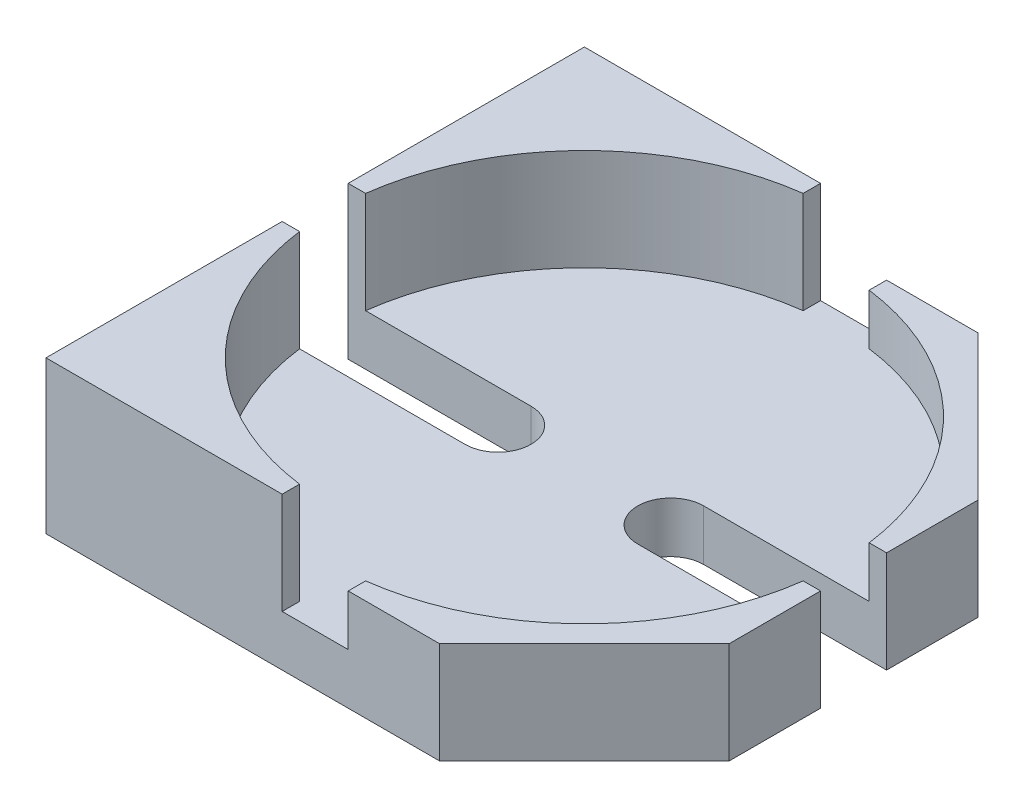
ISO-10303-21;
HEADER;
FILE_DESCRIPTION(('STEP AP214'),'2;1');
FILE_NAME('part.step','',(''),(''),'','','');
FILE_SCHEMA(('AUTOMOTIVE_DESIGN { 1 0 10303 214 1 1 1 1 }'));
ENDSEC;
DATA;
#1=APPLICATION_CONTEXT('core data for automotive mechanical design processes');
#2=APPLICATION_PROTOCOL_DEFINITION('international standard','automotive_design',2000,#1);
#3=PRODUCT_CONTEXT('',#1,'mechanical');
#4=PRODUCT('Part','Part','',(#3));
#5=PRODUCT_RELATED_PRODUCT_CATEGORY('part','',(#4));
#6=PRODUCT_DEFINITION_FORMATION('','',#4);
#7=PRODUCT_DEFINITION_CONTEXT('part definition',#1,'design');
#8=PRODUCT_DEFINITION('design','',#6,#7);
#9=PRODUCT_DEFINITION_SHAPE('','',#8);
#10=(LENGTH_UNIT() NAMED_UNIT(*) SI_UNIT(.MILLI.,.METRE.));
#11=(NAMED_UNIT(*) PLANE_ANGLE_UNIT() SI_UNIT($,.RADIAN.));
#12=(NAMED_UNIT(*) SI_UNIT($,.STERADIAN.) SOLID_ANGLE_UNIT());
#13=UNCERTAINTY_MEASURE_WITH_UNIT(LENGTH_MEASURE(1.E-05),#10,'distance_accuracy_value','');
#14=(GEOMETRIC_REPRESENTATION_CONTEXT(3) GLOBAL_UNCERTAINTY_ASSIGNED_CONTEXT((#13)) GLOBAL_UNIT_ASSIGNED_CONTEXT((#10,
#11,#12)) REPRESENTATION_CONTEXT('',''));
#15=CARTESIAN_POINT('',(0.,0.,0.));
#16=DIRECTION('',(0.,0.,1.));
#17=DIRECTION('',(1.,0.,0.));
#18=AXIS2_PLACEMENT_3D('',#15,#16,#17);
#19=CARTESIAN_POINT('',(0.,1.,0.));
#20=DIRECTION('',(0.,1.,0.));
#21=DIRECTION('',(1.,0.,0.));
#22=AXIS2_PLACEMENT_3D('',#19,#20,#21);
#23=PLANE('',#22);
#24=CARTESIAN_POINT('',(0.,1.,0.));
#25=DIRECTION('',(0.,1.,0.));
#26=DIRECTION('',(0.,0.,1.));
#27=AXIS2_PLACEMENT_3D('',#24,#25,#26);
#28=CIRCLE('',#27,2.5);
#29=CARTESIAN_POINT('',(0.325000000000007,1.,2.47878498462453));
#30=VERTEX_POINT('',#29);
#31=CARTESIAN_POINT('',(2.47878498462453,1.,0.325));
#32=VERTEX_POINT('',#31);
#33=EDGE_CURVE('E25',#30,#32,#28,.T.);
#34=ORIENTED_EDGE('',*,*,#33,.F.);
#35=DIRECTION('',(0.,0.,-1.));
#36=VECTOR('',#35,1.);
#37=CARTESIAN_POINT('',(0.325000000000007,1.,0.));
#38=LINE('',#37,#36);
#39=CARTESIAN_POINT('',(0.325000000000007,1.,2.65));
#40=VERTEX_POINT('',#39);
#41=EDGE_CURVE('E11',#40,#30,#38,.T.);
#42=ORIENTED_EDGE('',*,*,#41,.F.);
#43=DIRECTION('',(1.,0.,0.));
#44=VECTOR('',#43,1.);
#45=CARTESIAN_POINT('',(0.,1.,2.65));
#46=LINE('',#45,#44);
#47=CARTESIAN_POINT('',(1.22500000000002,1.,2.65));
#48=VERTEX_POINT('',#47);
#49=EDGE_CURVE('E353',#40,#48,#46,.T.);
#50=ORIENTED_EDGE('',*,*,#49,.T.);
#51=DIRECTION('',(0.707106781186544,0.,-0.707106781186552));
#52=VECTOR('',#51,1.);
#53=CARTESIAN_POINT('',(1.9375,1.,1.9375));
#54=LINE('',#53,#52);
#55=CARTESIAN_POINT('',(2.65,1.,1.225));
#56=VERTEX_POINT('',#55);
#57=EDGE_CURVE('E397',#48,#56,#54,.T.);
#58=ORIENTED_EDGE('',*,*,#57,.T.);
#59=DIRECTION('',(0.,0.,-1.));
#60=VECTOR('',#59,1.);
#61=CARTESIAN_POINT('',(2.65,1.,0.));
#62=LINE('',#61,#60);
#63=CARTESIAN_POINT('',(2.65,1.,0.325));
#64=VERTEX_POINT('',#63);
#65=EDGE_CURVE('E424',#56,#64,#62,.T.);
#66=ORIENTED_EDGE('',*,*,#65,.T.);
#67=DIRECTION('',(-1.,0.,0.));
#68=VECTOR('',#67,1.);
#69=CARTESIAN_POINT('',(0.,1.,0.325));
#70=LINE('',#69,#68);
#71=EDGE_CURVE('E408',#64,#32,#70,.T.);
#72=ORIENTED_EDGE('',*,*,#71,.T.);
#73=EDGE_LOOP('',(#34,#42,#50,#58,#66,#72));
#74=FACE_BOUND('',#73,.T.);
#75=ADVANCED_FACE('F17',(#74),#23,.T.);
#76=CARTESIAN_POINT('',(0.325000000000007,1.,0.));
#77=DIRECTION('',(-1.,0.,0.));
#78=DIRECTION('',(0.,0.,1.));
#79=AXIS2_PLACEMENT_3D('',#76,#77,#78);
#80=PLANE('',#79);
#81=DIRECTION('',(0.,0.,-1.));
#82=VECTOR('',#81,1.);
#83=CARTESIAN_POINT('',(0.325000000000007,0.5,0.));
#84=LINE('',#83,#82);
#85=CARTESIAN_POINT('',(0.325000000000007,0.5,2.65));
#86=VERTEX_POINT('',#85);
#87=CARTESIAN_POINT('',(0.325000000000007,0.5,2.47878498462453));
#88=VERTEX_POINT('',#87);
#89=EDGE_CURVE('E251',#86,#88,#84,.T.);
#90=ORIENTED_EDGE('',*,*,#89,.F.);
#91=DIRECTION('',(0.,-1.,0.));
#92=VECTOR('',#91,1.);
#93=CARTESIAN_POINT('',(0.325000000000007,1.,2.65));
#94=LINE('',#93,#92);
#95=EDGE_CURVE('E356',#40,#86,#94,.T.);
#96=ORIENTED_EDGE('',*,*,#95,.F.);
#97=ORIENTED_EDGE('',*,*,#41,.T.);
#98=DIRECTION('',(0.,-1.,0.));
#99=VECTOR('',#98,1.);
#100=CARTESIAN_POINT('',(0.325000000000007,1.,2.47878498462453));
#101=LINE('',#100,#99);
#102=EDGE_CURVE('E248',#30,#88,#101,.T.);
#103=ORIENTED_EDGE('',*,*,#102,.T.);
#104=EDGE_LOOP('',(#90,#96,#97,#103));
#105=FACE_BOUND('',#104,.T.);
#106=ADVANCED_FACE('F250',(#105),#80,.T.);
#107=CARTESIAN_POINT('',(0.,1.,0.));
#108=DIRECTION('',(0.,-1.,0.));
#109=DIRECTION('',(0.,0.,-1.));
#110=AXIS2_PLACEMENT_3D('',#107,#108,#109);
#111=CYLINDRICAL_SURFACE('',#110,2.5);
#112=CARTESIAN_POINT('',(0.,0.5,0.));
#113=DIRECTION('',(0.,1.,0.));
#114=DIRECTION('',(0.,0.,1.));
#115=AXIS2_PLACEMENT_3D('',#112,#113,#114);
#116=CIRCLE('',#115,2.5);
#117=CARTESIAN_POINT('',(2.47878498462453,0.5,0.325));
#118=VERTEX_POINT('',#117);
#119=EDGE_CURVE('E261',#88,#118,#116,.T.);
#120=ORIENTED_EDGE('',*,*,#119,.F.);
#121=ORIENTED_EDGE('',*,*,#102,.F.);
#122=ORIENTED_EDGE('',*,*,#33,.T.);
#123=DIRECTION('',(0.,-1.,0.));
#124=VECTOR('',#123,1.);
#125=CARTESIAN_POINT('',(2.47878498462453,1.,0.325));
#126=LINE('',#125,#124);
#127=EDGE_CURVE('E270',#32,#118,#126,.T.);
#128=ORIENTED_EDGE('',*,*,#127,.T.);
#129=EDGE_LOOP('',(#120,#121,#122,#128));
#130=FACE_BOUND('',#129,.T.);
#131=ADVANCED_FACE('F268',(#130),#111,.F.);
#132=CARTESIAN_POINT('',(0.,1.,0.));
#133=DIRECTION('',(0.,1.,0.));
#134=DIRECTION('',(1.,0.,0.));
#135=AXIS2_PLACEMENT_3D('',#132,#133,#134);
#136=PLANE('',#135);
#137=CARTESIAN_POINT('',(0.,1.,0.));
#138=DIRECTION('',(0.,1.,0.));
#139=DIRECTION('',(0.,0.,1.));
#140=AXIS2_PLACEMENT_3D('',#137,#138,#139);
#141=CIRCLE('',#140,2.5);
#142=CARTESIAN_POINT('',(2.47878498462453,1.,-0.325));
#143=VERTEX_POINT('',#142);
#144=CARTESIAN_POINT('',(0.325000000000015,1.,-2.47878498462452));
#145=VERTEX_POINT('',#144);
#146=EDGE_CURVE('E316',#143,#145,#141,.T.);
#147=ORIENTED_EDGE('',*,*,#146,.F.);
#148=DIRECTION('',(1.,0.,0.));
#149=VECTOR('',#148,1.);
#150=CARTESIAN_POINT('',(0.,1.,-0.325));
#151=LINE('',#150,#149);
#152=CARTESIAN_POINT('',(2.65,1.,-0.325));
#153=VERTEX_POINT('',#152);
#154=EDGE_CURVE('E402',#143,#153,#151,.T.);
#155=ORIENTED_EDGE('',*,*,#154,.T.);
#156=DIRECTION('',(0.,0.,-1.));
#157=VECTOR('',#156,1.);
#158=CARTESIAN_POINT('',(2.65,1.,0.));
#159=LINE('',#158,#157);
#160=CARTESIAN_POINT('',(2.65,1.,-1.225));
#161=VERTEX_POINT('',#160);
#162=EDGE_CURVE('E338',#153,#161,#159,.T.);
#163=ORIENTED_EDGE('',*,*,#162,.T.);
#164=DIRECTION('',(-0.707106781186549,0.,-0.707106781186546));
#165=VECTOR('',#164,1.);
#166=CARTESIAN_POINT('',(1.9375,1.,-1.9375));
#167=LINE('',#166,#165);
#168=CARTESIAN_POINT('',(1.225,1.,-2.65));
#169=VERTEX_POINT('',#168);
#170=EDGE_CURVE('E282',#161,#169,#167,.T.);
#171=ORIENTED_EDGE('',*,*,#170,.T.);
#172=DIRECTION('',(-1.,0.,0.));
#173=VECTOR('',#172,1.);
#174=CARTESIAN_POINT('',(0.,1.,-2.65));
#175=LINE('',#174,#173);
#176=CARTESIAN_POINT('',(0.325000000000015,1.,-2.65));
#177=VERTEX_POINT('',#176);
#178=EDGE_CURVE('E472',#169,#177,#175,.T.);
#179=ORIENTED_EDGE('',*,*,#178,.T.);
#180=DIRECTION('',(0.,0.,1.));
#181=VECTOR('',#180,1.);
#182=CARTESIAN_POINT('',(0.325000000000015,1.,0.));
#183=LINE('',#182,#181);
#184=EDGE_CURVE('E47',#177,#145,#183,.T.);
#185=ORIENTED_EDGE('',*,*,#184,.T.);
#186=EDGE_LOOP('',(#147,#155,#163,#171,#179,#185));
#187=FACE_BOUND('',#186,.T.);
#188=ADVANCED_FACE('F617',(#187),#136,.T.);
#189=CARTESIAN_POINT('',(0.325000000000015,1.,0.));
#190=DIRECTION('',(1.,0.,0.));
#191=DIRECTION('',(0.,1.,0.));
#192=AXIS2_PLACEMENT_3D('',#189,#190,#191);
#193=PLANE('',#192);
#194=DIRECTION('',(0.,0.,1.));
#195=VECTOR('',#194,1.);
#196=CARTESIAN_POINT('',(0.325000000000015,0.5,0.));
#197=LINE('',#196,#195);
#198=CARTESIAN_POINT('',(0.325000000000015,0.5,-2.65));
#199=VERTEX_POINT('',#198);
#200=CARTESIAN_POINT('',(0.325000000000015,0.5,-2.47878498462452));
#201=VERTEX_POINT('',#200);
#202=EDGE_CURVE('E325',#199,#201,#197,.T.);
#203=ORIENTED_EDGE('',*,*,#202,.T.);
#204=DIRECTION('',(0.,-1.,0.));
#205=VECTOR('',#204,1.);
#206=CARTESIAN_POINT('',(0.325000000000015,1.,-2.47878498462452));
#207=LINE('',#206,#205);
#208=EDGE_CURVE('E420',#145,#201,#207,.T.);
#209=ORIENTED_EDGE('',*,*,#208,.F.);
#210=ORIENTED_EDGE('',*,*,#184,.F.);
#211=DIRECTION('',(0.,-1.,0.));
#212=VECTOR('',#211,1.);
#213=CARTESIAN_POINT('',(0.325000000000015,1.,-2.65));
#214=LINE('',#213,#212);
#215=EDGE_CURVE('E493',#177,#199,#214,.T.);
#216=ORIENTED_EDGE('',*,*,#215,.T.);
#217=EDGE_LOOP('',(#203,#209,#210,#216));
#218=FACE_BOUND('',#217,.T.);
#219=ADVANCED_FACE('F567',(#218),#193,.F.);
#220=CARTESIAN_POINT('',(0.,1.,0.));
#221=DIRECTION('',(0.,-1.,0.));
#222=DIRECTION('',(0.,0.,-1.));
#223=AXIS2_PLACEMENT_3D('',#220,#221,#222);
#224=CYLINDRICAL_SURFACE('',#223,2.5);
#225=CARTESIAN_POINT('',(0.,0.5,0.));
#226=DIRECTION('',(0.,1.,0.));
#227=DIRECTION('',(0.,0.,1.));
#228=AXIS2_PLACEMENT_3D('',#225,#226,#227);
#229=CIRCLE('',#228,2.5);
#230=CARTESIAN_POINT('',(2.47878498462453,0.5,-0.325));
#231=VERTEX_POINT('',#230);
#232=EDGE_CURVE('E321',#231,#201,#229,.T.);
#233=ORIENTED_EDGE('',*,*,#232,.F.);
#234=DIRECTION('',(0.,-1.,0.));
#235=VECTOR('',#234,1.);
#236=CARTESIAN_POINT('',(2.47878498462453,1.,-0.325));
#237=LINE('',#236,#235);
#238=EDGE_CURVE('E406',#143,#231,#237,.T.);
#239=ORIENTED_EDGE('',*,*,#238,.F.);
#240=ORIENTED_EDGE('',*,*,#146,.T.);
#241=ORIENTED_EDGE('',*,*,#208,.T.);
#242=EDGE_LOOP('',(#233,#239,#240,#241));
#243=FACE_BOUND('',#242,.T.);
#244=ADVANCED_FACE('F563',(#243),#224,.F.);
#245=CARTESIAN_POINT('',(0.,1.5,0.));
#246=DIRECTION('',(0.,1.,0.));
#247=DIRECTION('',(1.,0.,0.));
#248=AXIS2_PLACEMENT_3D('',#245,#246,#247);
#249=PLANE('',#248);
#250=CARTESIAN_POINT('',(0.,1.5,0.));
#251=DIRECTION('',(0.,1.,0.));
#252=DIRECTION('',(0.,0.,1.));
#253=AXIS2_PLACEMENT_3D('',#250,#251,#252);
#254=CIRCLE('',#253,2.5);
#255=CARTESIAN_POINT('',(-2.47878498462453,1.5,0.325));
#256=VERTEX_POINT('',#255);
#257=CARTESIAN_POINT('',(-0.325000000000006,1.5,2.47878498462453));
#258=VERTEX_POINT('',#257);
#259=EDGE_CURVE('E432',#256,#258,#254,.T.);
#260=ORIENTED_EDGE('',*,*,#259,.F.);
#261=DIRECTION('',(-1.,0.,0.));
#262=VECTOR('',#261,1.);
#263=CARTESIAN_POINT('',(0.,1.5,0.325));
#264=LINE('',#263,#262);
#265=CARTESIAN_POINT('',(-2.65,1.5,0.325));
#266=VERTEX_POINT('',#265);
#267=EDGE_CURVE('E384',#256,#266,#264,.T.);
#268=ORIENTED_EDGE('',*,*,#267,.T.);
#269=DIRECTION('',(0.,0.,1.));
#270=VECTOR('',#269,1.);
#271=CARTESIAN_POINT('',(-2.65,1.5,0.));
#272=LINE('',#271,#270);
#273=CARTESIAN_POINT('',(-2.65,1.5,2.65));
#274=VERTEX_POINT('',#273);
#275=EDGE_CURVE('E366',#266,#274,#272,.T.);
#276=ORIENTED_EDGE('',*,*,#275,.T.);
#277=DIRECTION('',(1.,0.,0.));
#278=VECTOR('',#277,1.);
#279=CARTESIAN_POINT('',(0.,1.5,2.65));
#280=LINE('',#279,#278);
#281=CARTESIAN_POINT('',(-0.325000000000006,1.5,2.65));
#282=VERTEX_POINT('',#281);
#283=EDGE_CURVE('E308',#274,#282,#280,.T.);
#284=ORIENTED_EDGE('',*,*,#283,.T.);
#285=DIRECTION('',(0.,0.,-1.));
#286=VECTOR('',#285,1.);
#287=CARTESIAN_POINT('',(-0.325000000000007,1.5,0.));
#288=LINE('',#287,#286);
#289=EDGE_CURVE('E313',#282,#258,#288,.T.);
#290=ORIENTED_EDGE('',*,*,#289,.T.);
#291=EDGE_LOOP('',(#260,#268,#276,#284,#290));
#292=FACE_BOUND('',#291,.T.);
#293=ADVANCED_FACE('F672',(#292),#249,.T.);
#294=CARTESIAN_POINT('',(-0.325000000000007,1.5,0.));
#295=DIRECTION('',(-1.,0.,0.));
#296=DIRECTION('',(0.,1.,0.));
#297=AXIS2_PLACEMENT_3D('',#294,#295,#296);
#298=PLANE('',#297);
#299=DIRECTION('',(0.,0.,-1.));
#300=VECTOR('',#299,1.);
#301=CARTESIAN_POINT('',(-0.325000000000007,0.5,0.));
#302=LINE('',#301,#300);
#303=CARTESIAN_POINT('',(-0.325000000000006,0.5,2.65));
#304=VERTEX_POINT('',#303);
#305=CARTESIAN_POINT('',(-0.325000000000006,0.5,2.47878498462453));
#306=VERTEX_POINT('',#305);
#307=EDGE_CURVE('E288',#304,#306,#302,.T.);
#308=ORIENTED_EDGE('',*,*,#307,.T.);
#309=DIRECTION('',(0.,-1.,0.));
#310=VECTOR('',#309,1.);
#311=CARTESIAN_POINT('',(-0.325000000000006,1.5,2.47878498462453));
#312=LINE('',#311,#310);
#313=EDGE_CURVE('E317',#258,#306,#312,.T.);
#314=ORIENTED_EDGE('',*,*,#313,.F.);
#315=ORIENTED_EDGE('',*,*,#289,.F.);
#316=DIRECTION('',(0.,-1.,0.));
#317=VECTOR('',#316,1.);
#318=CARTESIAN_POINT('',(-0.325000000000006,1.5,2.65));
#319=LINE('',#318,#317);
#320=EDGE_CURVE('E383',#282,#304,#319,.T.);
#321=ORIENTED_EDGE('',*,*,#320,.T.);
#322=EDGE_LOOP('',(#308,#314,#315,#321));
#323=FACE_BOUND('',#322,.T.);
#324=ADVANCED_FACE('F600',(#323),#298,.F.);
#325=CARTESIAN_POINT('',(0.,1.5,0.));
#326=DIRECTION('',(0.,-1.,0.));
#327=DIRECTION('',(0.,0.,-1.));
#328=AXIS2_PLACEMENT_3D('',#325,#326,#327);
#329=CYLINDRICAL_SURFACE('',#328,2.5);
#330=CARTESIAN_POINT('',(0.,0.5,0.));
#331=DIRECTION('',(0.,1.,0.));
#332=DIRECTION('',(0.,0.,1.));
#333=AXIS2_PLACEMENT_3D('',#330,#331,#332);
#334=CIRCLE('',#333,2.5);
#335=CARTESIAN_POINT('',(-2.47878498462453,0.5,0.325));
#336=VERTEX_POINT('',#335);
#337=EDGE_CURVE('E291',#336,#306,#334,.T.);
#338=ORIENTED_EDGE('',*,*,#337,.F.);
#339=DIRECTION('',(0.,-1.,0.));
#340=VECTOR('',#339,1.);
#341=CARTESIAN_POINT('',(-2.47878498462453,1.5,0.325));
#342=LINE('',#341,#340);
#343=EDGE_CURVE('E387',#256,#336,#342,.T.);
#344=ORIENTED_EDGE('',*,*,#343,.F.);
#345=ORIENTED_EDGE('',*,*,#259,.T.);
#346=ORIENTED_EDGE('',*,*,#313,.T.);
#347=EDGE_LOOP('',(#338,#344,#345,#346));
#348=FACE_BOUND('',#347,.T.);
#349=ADVANCED_FACE('F597',(#348),#329,.F.);
#350=CARTESIAN_POINT('',(0.,1.5,0.));
#351=DIRECTION('',(0.,1.,0.));
#352=DIRECTION('',(1.,0.,0.));
#353=AXIS2_PLACEMENT_3D('',#350,#351,#352);
#354=PLANE('',#353);
#355=CARTESIAN_POINT('',(0.,1.5,0.));
#356=DIRECTION('',(0.,1.,0.));
#357=DIRECTION('',(0.,0.,1.));
#358=AXIS2_PLACEMENT_3D('',#355,#356,#357);
#359=CIRCLE('',#358,2.5);
#360=CARTESIAN_POINT('',(-0.325000000000009,1.5,-2.47878498462453));
#361=VERTEX_POINT('',#360);
#362=CARTESIAN_POINT('',(-2.47878498462453,1.5,-0.325));
#363=VERTEX_POINT('',#362);
#364=EDGE_CURVE('E433',#361,#363,#359,.T.);
#365=ORIENTED_EDGE('',*,*,#364,.F.);
#366=DIRECTION('',(0.,0.,1.));
#367=VECTOR('',#366,1.);
#368=CARTESIAN_POINT('',(-0.325000000000008,1.5,0.));
#369=LINE('',#368,#367);
#370=CARTESIAN_POINT('',(-0.32500000000001,1.5,-2.65));
#371=VERTEX_POINT('',#370);
#372=EDGE_CURVE('E429',#371,#361,#369,.T.);
#373=ORIENTED_EDGE('',*,*,#372,.F.);
#374=DIRECTION('',(-1.,0.,0.));
#375=VECTOR('',#374,1.);
#376=CARTESIAN_POINT('',(0.,1.5,-2.65));
#377=LINE('',#376,#375);
#378=CARTESIAN_POINT('',(-2.65,1.5,-2.65));
#379=VERTEX_POINT('',#378);
#380=EDGE_CURVE('E486',#371,#379,#377,.T.);
#381=ORIENTED_EDGE('',*,*,#380,.T.);
#382=DIRECTION('',(0.,0.,1.));
#383=VECTOR('',#382,1.);
#384=CARTESIAN_POINT('',(-2.65,1.5,0.));
#385=LINE('',#384,#383);
#386=CARTESIAN_POINT('',(-2.65,1.5,-0.325));
#387=VERTEX_POINT('',#386);
#388=EDGE_CURVE('E504',#379,#387,#385,.T.);
#389=ORIENTED_EDGE('',*,*,#388,.T.);
#390=DIRECTION('',(1.,0.,0.));
#391=VECTOR('',#390,1.);
#392=CARTESIAN_POINT('',(0.,1.5,-0.325));
#393=LINE('',#392,#391);
#394=EDGE_CURVE('E509',#387,#363,#393,.T.);
#395=ORIENTED_EDGE('',*,*,#394,.T.);
#396=EDGE_LOOP('',(#365,#373,#381,#389,#395));
#397=FACE_BOUND('',#396,.T.);
#398=ADVANCED_FACE('F664',(#397),#354,.T.);
#399=CARTESIAN_POINT('',(-0.325000000000008,1.5,0.));
#400=DIRECTION('',(1.,0.,0.));
#401=DIRECTION('',(0.,0.,-1.));
#402=AXIS2_PLACEMENT_3D('',#399,#400,#401);
#403=PLANE('',#402);
#404=DIRECTION('',(0.,0.,1.));
#405=VECTOR('',#404,1.);
#406=CARTESIAN_POINT('',(-0.325000000000008,0.5,0.));
#407=LINE('',#406,#405);
#408=CARTESIAN_POINT('',(-0.32500000000001,0.5,-2.65));
#409=VERTEX_POINT('',#408);
#410=CARTESIAN_POINT('',(-0.325000000000009,0.5,-2.47878498462453));
#411=VERTEX_POINT('',#410);
#412=EDGE_CURVE('E293',#409,#411,#407,.T.);
#413=ORIENTED_EDGE('',*,*,#412,.F.);
#414=DIRECTION('',(0.,-1.,0.));
#415=VECTOR('',#414,1.);
#416=CARTESIAN_POINT('',(-0.32500000000001,1.5,-2.65));
#417=LINE('',#416,#415);
#418=EDGE_CURVE('E490',#371,#409,#417,.T.);
#419=ORIENTED_EDGE('',*,*,#418,.F.);
#420=ORIENTED_EDGE('',*,*,#372,.T.);
#421=DIRECTION('',(0.,-1.,0.));
#422=VECTOR('',#421,1.);
#423=CARTESIAN_POINT('',(-0.325000000000009,1.5,-2.47878498462453));
#424=LINE('',#423,#422);
#425=EDGE_CURVE('E532',#361,#411,#424,.T.);
#426=ORIENTED_EDGE('',*,*,#425,.T.);
#427=EDGE_LOOP('',(#413,#419,#420,#426));
#428=FACE_BOUND('',#427,.T.);
#429=ADVANCED_FACE('F576',(#428),#403,.T.);
#430=CARTESIAN_POINT('',(0.,1.5,0.));
#431=DIRECTION('',(0.,-1.,0.));
#432=DIRECTION('',(0.,0.,-1.));
#433=AXIS2_PLACEMENT_3D('',#430,#431,#432);
#434=CYLINDRICAL_SURFACE('',#433,2.5);
#435=CARTESIAN_POINT('',(0.,0.5,0.));
#436=DIRECTION('',(0.,1.,0.));
#437=DIRECTION('',(0.,0.,1.));
#438=AXIS2_PLACEMENT_3D('',#435,#436,#437);
#439=CIRCLE('',#438,2.5);
#440=CARTESIAN_POINT('',(-2.47878498462453,0.5,-0.325));
#441=VERTEX_POINT('',#440);
#442=EDGE_CURVE('E297',#411,#441,#439,.T.);
#443=ORIENTED_EDGE('',*,*,#442,.F.);
#444=ORIENTED_EDGE('',*,*,#425,.F.);
#445=ORIENTED_EDGE('',*,*,#364,.T.);
#446=DIRECTION('',(0.,-1.,0.));
#447=VECTOR('',#446,1.);
#448=CARTESIAN_POINT('',(-2.47878498462453,1.5,-0.325));
#449=LINE('',#448,#447);
#450=EDGE_CURVE('E521',#363,#441,#449,.T.);
#451=ORIENTED_EDGE('',*,*,#450,.T.);
#452=EDGE_LOOP('',(#443,#444,#445,#451));
#453=FACE_BOUND('',#452,.T.);
#454=ADVANCED_FACE('F581',(#453),#434,.F.);
#455=CARTESIAN_POINT('',(0.85,0.,0.));
#456=DIRECTION('',(0.,1.,0.));
#457=DIRECTION('',(1.,0.,0.));
#458=AXIS2_PLACEMENT_3D('',#455,#456,#457);
#459=PLANE('',#458);
#460=DIRECTION('',(0.,0.,1.));
#461=VECTOR('',#460,1.);
#462=CARTESIAN_POINT('',(-2.65,0.,0.325));
#463=LINE('',#462,#461);
#464=CARTESIAN_POINT('',(-2.65,0.,0.325));
#465=VERTEX_POINT('',#464);
#466=CARTESIAN_POINT('',(-2.65,0.,2.65));
#467=VERTEX_POINT('',#466);
#468=EDGE_CURVE('E266',#465,#467,#463,.T.);
#469=ORIENTED_EDGE('',*,*,#468,.F.);
#470=DIRECTION('',(-1.,0.,0.));
#471=VECTOR('',#470,1.);
#472=CARTESIAN_POINT('',(-0.85,0.,0.325));
#473=LINE('',#472,#471);
#474=CARTESIAN_POINT('',(-0.85,0.,0.325));
#475=VERTEX_POINT('',#474);
#476=EDGE_CURVE('E388',#475,#465,#473,.T.);
#477=ORIENTED_EDGE('',*,*,#476,.F.);
#478=CARTESIAN_POINT('',(-0.85,0.,0.));
#479=DIRECTION('',(0.,-1.,0.));
#480=DIRECTION('',(0.,0.,1.));
#481=AXIS2_PLACEMENT_3D('',#478,#479,#480);
#482=CIRCLE('',#481,0.325);
#483=CARTESIAN_POINT('',(-0.85,0.,-0.325));
#484=VERTEX_POINT('',#483);
#485=EDGE_CURVE('E505',#484,#475,#482,.T.);
#486=ORIENTED_EDGE('',*,*,#485,.F.);
#487=DIRECTION('',(1.,0.,0.));
#488=VECTOR('',#487,1.);
#489=CARTESIAN_POINT('',(-0.85,0.,-0.325));
#490=LINE('',#489,#488);
#491=CARTESIAN_POINT('',(-2.65,0.,-0.325));
#492=VERTEX_POINT('',#491);
#493=EDGE_CURVE('E513',#492,#484,#490,.T.);
#494=ORIENTED_EDGE('',*,*,#493,.F.);
#495=DIRECTION('',(0.,0.,1.));
#496=VECTOR('',#495,1.);
#497=CARTESIAN_POINT('',(-2.65,0.,-2.65));
#498=LINE('',#497,#496);
#499=CARTESIAN_POINT('',(-2.65,0.,-2.65));
#500=VERTEX_POINT('',#499);
#501=EDGE_CURVE('E467',#500,#492,#498,.T.);
#502=ORIENTED_EDGE('',*,*,#501,.F.);
#503=DIRECTION('',(-1.,0.,0.));
#504=VECTOR('',#503,1.);
#505=CARTESIAN_POINT('',(1.225,0.,-2.65));
#506=LINE('',#505,#504);
#507=CARTESIAN_POINT('',(1.225,0.,-2.65));
#508=VERTEX_POINT('',#507);
#509=EDGE_CURVE('E286',#508,#500,#506,.T.);
#510=ORIENTED_EDGE('',*,*,#509,.F.);
#511=DIRECTION('',(-0.707106781186549,0.,-0.707106781186546));
#512=VECTOR('',#511,1.);
#513=CARTESIAN_POINT('',(1.225,0.,-2.65));
#514=LINE('',#513,#512);
#515=CARTESIAN_POINT('',(2.65,0.,-1.225));
#516=VERTEX_POINT('',#515);
#517=EDGE_CURVE('E334',#516,#508,#514,.T.);
#518=ORIENTED_EDGE('',*,*,#517,.F.);
#519=DIRECTION('',(0.,0.,-1.));
#520=VECTOR('',#519,1.);
#521=CARTESIAN_POINT('',(2.65,0.,-1.225));
#522=LINE('',#521,#520);
#523=CARTESIAN_POINT('',(2.65,0.,-0.325));
#524=VERTEX_POINT('',#523);
#525=EDGE_CURVE('E462',#524,#516,#522,.T.);
#526=ORIENTED_EDGE('',*,*,#525,.F.);
#527=DIRECTION('',(1.,0.,0.));
#528=VECTOR('',#527,1.);
#529=CARTESIAN_POINT('',(0.85,0.,-0.325));
#530=LINE('',#529,#528);
#531=CARTESIAN_POINT('',(0.85,0.,-0.325));
#532=VERTEX_POINT('',#531);
#533=EDGE_CURVE('E450',#532,#524,#530,.T.);
#534=ORIENTED_EDGE('',*,*,#533,.F.);
#535=CARTESIAN_POINT('',(0.85,0.,0.));
#536=DIRECTION('',(0.,-1.,0.));
#537=DIRECTION('',(0.,0.,1.));
#538=AXIS2_PLACEMENT_3D('',#535,#536,#537);
#539=CIRCLE('',#538,0.325);
#540=CARTESIAN_POINT('',(0.85,0.,0.325));
#541=VERTEX_POINT('',#540);
#542=EDGE_CURVE('E412',#541,#532,#539,.T.);
#543=ORIENTED_EDGE('',*,*,#542,.F.);
#544=DIRECTION('',(-1.,0.,0.));
#545=VECTOR('',#544,1.);
#546=CARTESIAN_POINT('',(0.85,0.,0.325));
#547=LINE('',#546,#545);
#548=CARTESIAN_POINT('',(2.65,0.,0.325));
#549=VERTEX_POINT('',#548);
#550=EDGE_CURVE('E428',#549,#541,#547,.T.);
#551=ORIENTED_EDGE('',*,*,#550,.F.);
#552=DIRECTION('',(0.,0.,-1.));
#553=VECTOR('',#552,1.);
#554=CARTESIAN_POINT('',(2.65,0.,0.325));
#555=LINE('',#554,#553);
#556=CARTESIAN_POINT('',(2.65,0.,1.225));
#557=VERTEX_POINT('',#556);
#558=EDGE_CURVE('E401',#557,#549,#555,.T.);
#559=ORIENTED_EDGE('',*,*,#558,.F.);
#560=DIRECTION('',(0.707106781186544,0.,-0.707106781186552));
#561=VECTOR('',#560,1.);
#562=CARTESIAN_POINT('',(1.22500000000002,0.,2.65));
#563=LINE('',#562,#561);
#564=CARTESIAN_POINT('',(1.22500000000002,0.,2.65));
#565=VERTEX_POINT('',#564);
#566=EDGE_CURVE('E303',#565,#557,#563,.T.);
#567=ORIENTED_EDGE('',*,*,#566,.F.);
#568=DIRECTION('',(1.,0.,0.));
#569=VECTOR('',#568,1.);
#570=CARTESIAN_POINT('',(1.22500000000002,0.,2.65));
#571=LINE('',#570,#569);
#572=EDGE_CURVE('E374',#467,#565,#571,.T.);
#573=ORIENTED_EDGE('',*,*,#572,.F.);
#574=EDGE_LOOP('',(#469,#477,#486,#494,#502,#510,#518,#526,#534,#543,#551,#559,#567,#573));
#575=FACE_BOUND('',#574,.T.);
#576=ADVANCED_FACE('F613',(#575),#459,.F.);
#577=CARTESIAN_POINT('',(-0.85,0.5,0.325));
#578=DIRECTION('',(0.,0.,1.));
#579=DIRECTION('',(1.,0.,0.));
#580=AXIS2_PLACEMENT_3D('',#577,#578,#579);
#581=PLANE('',#580);
#582=ORIENTED_EDGE('',*,*,#476,.T.);
#583=DIRECTION('',(0.,-1.,0.));
#584=VECTOR('',#583,1.);
#585=CARTESIAN_POINT('',(-2.65,0.5,0.325));
#586=LINE('',#585,#584);
#587=EDGE_CURVE('E370',#266,#465,#586,.T.);
#588=ORIENTED_EDGE('',*,*,#587,.F.);
#589=ORIENTED_EDGE('',*,*,#267,.F.);
#590=ORIENTED_EDGE('',*,*,#343,.T.);
#591=DIRECTION('',(-1.,0.,0.));
#592=VECTOR('',#591,1.);
#593=CARTESIAN_POINT('',(-0.85,0.5,0.325));
#594=LINE('',#593,#592);
#595=CARTESIAN_POINT('',(-0.85,0.5,0.325));
#596=VERTEX_POINT('',#595);
#597=EDGE_CURVE('E312',#596,#336,#594,.T.);
#598=ORIENTED_EDGE('',*,*,#597,.F.);
#599=DIRECTION('',(0.,-1.,0.));
#600=VECTOR('',#599,1.);
#601=CARTESIAN_POINT('',(-0.85,0.5,0.325));
#602=LINE('',#601,#600);
#603=EDGE_CURVE('E496',#596,#475,#602,.T.);
#604=ORIENTED_EDGE('',*,*,#603,.T.);
#605=EDGE_LOOP('',(#582,#588,#589,#590,#598,#604));
#606=FACE_BOUND('',#605,.T.);
#607=ADVANCED_FACE('F592',(#606),#581,.F.);
#608=CARTESIAN_POINT('',(-0.85,0.5,0.));
#609=DIRECTION('',(0.,-1.,0.));
#610=DIRECTION('',(0.,0.,-1.));
#611=AXIS2_PLACEMENT_3D('',#608,#609,#610);
#612=CYLINDRICAL_SURFACE('',#611,0.325);
#613=ORIENTED_EDGE('',*,*,#485,.T.);
#614=ORIENTED_EDGE('',*,*,#603,.F.);
#615=CARTESIAN_POINT('',(-0.85,0.5,0.));
#616=DIRECTION('',(0.,-1.,0.));
#617=DIRECTION('',(0.,0.,1.));
#618=AXIS2_PLACEMENT_3D('',#615,#616,#617);
#619=CIRCLE('',#618,0.325);
#620=CARTESIAN_POINT('',(-0.85,0.5,-0.325));
#621=VERTEX_POINT('',#620);
#622=EDGE_CURVE('E346',#621,#596,#619,.T.);
#623=ORIENTED_EDGE('',*,*,#622,.F.);
#624=DIRECTION('',(0.,-1.,0.));
#625=VECTOR('',#624,1.);
#626=CARTESIAN_POINT('',(-0.85,0.5,-0.325));
#627=LINE('',#626,#625);
#628=EDGE_CURVE('E517',#621,#484,#627,.T.);
#629=ORIENTED_EDGE('',*,*,#628,.T.);
#630=EDGE_LOOP('',(#613,#614,#623,#629));
#631=FACE_BOUND('',#630,.T.);
#632=ADVANCED_FACE('F588',(#631),#612,.F.);
#633=CARTESIAN_POINT('',(-0.85,0.5,-0.325));
#634=DIRECTION('',(0.,0.,-1.));
#635=DIRECTION('',(-1.,0.,0.));
#636=AXIS2_PLACEMENT_3D('',#633,#634,#635);
#637=PLANE('',#636);
#638=ORIENTED_EDGE('',*,*,#493,.T.);
#639=ORIENTED_EDGE('',*,*,#628,.F.);
#640=DIRECTION('',(1.,0.,0.));
#641=VECTOR('',#640,1.);
#642=CARTESIAN_POINT('',(-0.85,0.5,-0.325));
#643=LINE('',#642,#641);
#644=EDGE_CURVE('E342',#441,#621,#643,.T.);
#645=ORIENTED_EDGE('',*,*,#644,.F.);
#646=ORIENTED_EDGE('',*,*,#450,.F.);
#647=ORIENTED_EDGE('',*,*,#394,.F.);
#648=DIRECTION('',(0.,-1.,0.));
#649=VECTOR('',#648,1.);
#650=CARTESIAN_POINT('',(-2.65,0.5,-0.325));
#651=LINE('',#650,#649);
#652=EDGE_CURVE('E471',#387,#492,#651,.T.);
#653=ORIENTED_EDGE('',*,*,#652,.T.);
#654=EDGE_LOOP('',(#638,#639,#645,#646,#647,#653));
#655=FACE_BOUND('',#654,.T.);
#656=ADVANCED_FACE('F585',(#655),#637,.F.);
#657=CARTESIAN_POINT('',(-2.65,0.5,-2.65));
#658=DIRECTION('',(1.,0.,0.));
#659=DIRECTION('',(0.,0.,-1.));
#660=AXIS2_PLACEMENT_3D('',#657,#658,#659);
#661=PLANE('',#660);
#662=ORIENTED_EDGE('',*,*,#501,.T.);
#663=ORIENTED_EDGE('',*,*,#652,.F.);
#664=ORIENTED_EDGE('',*,*,#388,.F.);
#665=DIRECTION('',(0.,-1.,0.));
#666=VECTOR('',#665,1.);
#667=CARTESIAN_POINT('',(-2.65,0.5,-2.65));
#668=LINE('',#667,#666);
#669=EDGE_CURVE('E482',#379,#500,#668,.T.);
#670=ORIENTED_EDGE('',*,*,#669,.T.);
#671=EDGE_LOOP('',(#662,#663,#664,#670));
#672=FACE_BOUND('',#671,.T.);
#673=ADVANCED_FACE('F640',(#672),#661,.F.);
#674=CARTESIAN_POINT('',(1.225,0.5,-2.65));
#675=DIRECTION('',(0.,0.,1.));
#676=DIRECTION('',(1.,0.,0.));
#677=AXIS2_PLACEMENT_3D('',#674,#675,#676);
#678=PLANE('',#677);
#679=ORIENTED_EDGE('',*,*,#509,.T.);
#680=ORIENTED_EDGE('',*,*,#669,.F.);
#681=ORIENTED_EDGE('',*,*,#380,.F.);
#682=ORIENTED_EDGE('',*,*,#418,.T.);
#683=DIRECTION('',(-1.,0.,0.));
#684=VECTOR('',#683,1.);
#685=CARTESIAN_POINT('',(1.225,0.5,-2.65));
#686=LINE('',#685,#684);
#687=EDGE_CURVE('E298',#199,#409,#686,.T.);
#688=ORIENTED_EDGE('',*,*,#687,.F.);
#689=ORIENTED_EDGE('',*,*,#215,.F.);
#690=ORIENTED_EDGE('',*,*,#178,.F.);
#691=DIRECTION('',(0.,-1.,0.));
#692=VECTOR('',#691,1.);
#693=CARTESIAN_POINT('',(1.225,0.5,-2.65));
#694=LINE('',#693,#692);
#695=EDGE_CURVE('E287',#169,#508,#694,.T.);
#696=ORIENTED_EDGE('',*,*,#695,.T.);
#697=EDGE_LOOP('',(#679,#680,#681,#682,#688,#689,#690,#696));
#698=FACE_BOUND('',#697,.T.);
#699=ADVANCED_FACE('F570',(#698),#678,.F.);
#700=CARTESIAN_POINT('',(1.225,0.5,-2.65));
#701=DIRECTION('',(-0.707106781186546,0.,0.707106781186549));
#702=DIRECTION('',(0.,1.,0.));
#703=AXIS2_PLACEMENT_3D('',#700,#701,#702);
#704=PLANE('',#703);
#705=ORIENTED_EDGE('',*,*,#517,.T.);
#706=ORIENTED_EDGE('',*,*,#695,.F.);
#707=ORIENTED_EDGE('',*,*,#170,.F.);
#708=DIRECTION('',(0.,-1.,0.));
#709=VECTOR('',#708,1.);
#710=CARTESIAN_POINT('',(2.65,0.5,-1.225));
#711=LINE('',#710,#709);
#712=EDGE_CURVE('E466',#161,#516,#711,.T.);
#713=ORIENTED_EDGE('',*,*,#712,.T.);
#714=EDGE_LOOP('',(#705,#706,#707,#713));
#715=FACE_BOUND('',#714,.T.);
#716=ADVANCED_FACE('F647',(#715),#704,.F.);
#717=CARTESIAN_POINT('',(2.65,0.5,-1.225));
#718=DIRECTION('',(-1.,0.,0.));
#719=DIRECTION('',(0.,0.,1.));
#720=AXIS2_PLACEMENT_3D('',#717,#718,#719);
#721=PLANE('',#720);
#722=ORIENTED_EDGE('',*,*,#525,.T.);
#723=ORIENTED_EDGE('',*,*,#712,.F.);
#724=ORIENTED_EDGE('',*,*,#162,.F.);
#725=DIRECTION('',(0.,-1.,0.));
#726=VECTOR('',#725,1.);
#727=CARTESIAN_POINT('',(2.65,0.5,-0.325));
#728=LINE('',#727,#726);
#729=EDGE_CURVE('E407',#153,#524,#728,.T.);
#730=ORIENTED_EDGE('',*,*,#729,.T.);
#731=EDGE_LOOP('',(#722,#723,#724,#730));
#732=FACE_BOUND('',#731,.T.);
#733=ADVANCED_FACE('F615',(#732),#721,.F.);
#734=CARTESIAN_POINT('',(0.85,0.5,-0.325));
#735=DIRECTION('',(0.,0.,-1.));
#736=DIRECTION('',(0.,-1.,0.));
#737=AXIS2_PLACEMENT_3D('',#734,#735,#736);
#738=PLANE('',#737);
#739=ORIENTED_EDGE('',*,*,#533,.T.);
#740=ORIENTED_EDGE('',*,*,#729,.F.);
#741=ORIENTED_EDGE('',*,*,#154,.F.);
#742=ORIENTED_EDGE('',*,*,#238,.T.);
#743=DIRECTION('',(1.,0.,0.));
#744=VECTOR('',#743,1.);
#745=CARTESIAN_POINT('',(0.85,0.5,-0.325));
#746=LINE('',#745,#744);
#747=CARTESIAN_POINT('',(0.85,0.5,-0.325));
#748=VERTEX_POINT('',#747);
#749=EDGE_CURVE('E302',#748,#231,#746,.T.);
#750=ORIENTED_EDGE('',*,*,#749,.F.);
#751=DIRECTION('',(0.,-1.,0.));
#752=VECTOR('',#751,1.);
#753=CARTESIAN_POINT('',(0.85,0.5,-0.325));
#754=LINE('',#753,#752);
#755=EDGE_CURVE('E446',#748,#532,#754,.T.);
#756=ORIENTED_EDGE('',*,*,#755,.T.);
#757=EDGE_LOOP('',(#739,#740,#741,#742,#750,#756));
#758=FACE_BOUND('',#757,.T.);
#759=ADVANCED_FACE('F557',(#758),#738,.F.);
#760=CARTESIAN_POINT('',(0.85,0.5,0.));
#761=DIRECTION('',(0.,-1.,0.));
#762=DIRECTION('',(0.,0.,-1.));
#763=AXIS2_PLACEMENT_3D('',#760,#761,#762);
#764=CYLINDRICAL_SURFACE('',#763,0.325);
#765=ORIENTED_EDGE('',*,*,#542,.T.);
#766=ORIENTED_EDGE('',*,*,#755,.F.);
#767=CARTESIAN_POINT('',(0.85,0.5,0.));
#768=DIRECTION('',(0.,-1.,0.));
#769=DIRECTION('',(0.,0.,1.));
#770=AXIS2_PLACEMENT_3D('',#767,#768,#769);
#771=CIRCLE('',#770,0.325);
#772=CARTESIAN_POINT('',(0.85,0.5,0.325));
#773=VERTEX_POINT('',#772);
#774=EDGE_CURVE('E279',#773,#748,#771,.T.);
#775=ORIENTED_EDGE('',*,*,#774,.F.);
#776=DIRECTION('',(0.,-1.,0.));
#777=VECTOR('',#776,1.);
#778=CARTESIAN_POINT('',(0.85,0.5,0.325));
#779=LINE('',#778,#777);
#780=EDGE_CURVE('E437',#773,#541,#779,.T.);
#781=ORIENTED_EDGE('',*,*,#780,.T.);
#782=EDGE_LOOP('',(#765,#766,#775,#781));
#783=FACE_BOUND('',#782,.T.);
#784=ADVANCED_FACE('F555',(#783),#764,.F.);
#785=CARTESIAN_POINT('',(0.85,0.5,0.325));
#786=DIRECTION('',(0.,0.,1.));
#787=DIRECTION('',(1.,0.,0.));
#788=AXIS2_PLACEMENT_3D('',#785,#786,#787);
#789=PLANE('',#788);
#790=ORIENTED_EDGE('',*,*,#550,.T.);
#791=ORIENTED_EDGE('',*,*,#780,.F.);
#792=DIRECTION('',(-1.,0.,0.));
#793=VECTOR('',#792,1.);
#794=CARTESIAN_POINT('',(0.85,0.5,0.325));
#795=LINE('',#794,#793);
#796=EDGE_CURVE('E273',#118,#773,#795,.T.);
#797=ORIENTED_EDGE('',*,*,#796,.F.);
#798=ORIENTED_EDGE('',*,*,#127,.F.);
#799=ORIENTED_EDGE('',*,*,#71,.F.);
#800=DIRECTION('',(0.,-1.,0.));
#801=VECTOR('',#800,1.);
#802=CARTESIAN_POINT('',(2.65,0.5,0.325));
#803=LINE('',#802,#801);
#804=EDGE_CURVE('E416',#64,#549,#803,.T.);
#805=ORIENTED_EDGE('',*,*,#804,.T.);
#806=EDGE_LOOP('',(#790,#791,#797,#798,#799,#805));
#807=FACE_BOUND('',#806,.T.);
#808=ADVANCED_FACE('F551',(#807),#789,.F.);
#809=CARTESIAN_POINT('',(2.65,0.5,0.325));
#810=DIRECTION('',(-1.,0.,0.));
#811=DIRECTION('',(0.,1.,0.));
#812=AXIS2_PLACEMENT_3D('',#809,#810,#811);
#813=PLANE('',#812);
#814=ORIENTED_EDGE('',*,*,#558,.T.);
#815=ORIENTED_EDGE('',*,*,#804,.F.);
#816=ORIENTED_EDGE('',*,*,#65,.F.);
#817=DIRECTION('',(0.,-1.,0.));
#818=VECTOR('',#817,1.);
#819=CARTESIAN_POINT('',(2.65,0.5,1.225));
#820=LINE('',#819,#818);
#821=EDGE_CURVE('E307',#56,#557,#820,.T.);
#822=ORIENTED_EDGE('',*,*,#821,.T.);
#823=EDGE_LOOP('',(#814,#815,#816,#822));
#824=FACE_BOUND('',#823,.T.);
#825=ADVANCED_FACE('F610',(#824),#813,.F.);
#826=CARTESIAN_POINT('',(1.22500000000002,0.5,2.65));
#827=DIRECTION('',(-0.707106781186552,0.,-0.707106781186544));
#828=DIRECTION('',(-0.707106781186544,0.,0.707106781186552));
#829=AXIS2_PLACEMENT_3D('',#826,#827,#828);
#830=PLANE('',#829);
#831=ORIENTED_EDGE('',*,*,#566,.T.);
#832=ORIENTED_EDGE('',*,*,#821,.F.);
#833=ORIENTED_EDGE('',*,*,#57,.F.);
#834=DIRECTION('',(0.,-1.,0.));
#835=VECTOR('',#834,1.);
#836=CARTESIAN_POINT('',(1.22500000000002,0.5,2.65));
#837=LINE('',#836,#835);
#838=EDGE_CURVE('E357',#48,#565,#837,.T.);
#839=ORIENTED_EDGE('',*,*,#838,.T.);
#840=EDGE_LOOP('',(#831,#832,#833,#839));
#841=FACE_BOUND('',#840,.T.);
#842=ADVANCED_FACE('F608',(#841),#830,.F.);
#843=CARTESIAN_POINT('',(1.22500000000002,0.5,2.65));
#844=DIRECTION('',(0.,0.,-1.));
#845=DIRECTION('',(0.,-1.,0.));
#846=AXIS2_PLACEMENT_3D('',#843,#844,#845);
#847=PLANE('',#846);
#848=ORIENTED_EDGE('',*,*,#572,.T.);
#849=ORIENTED_EDGE('',*,*,#838,.F.);
#850=ORIENTED_EDGE('',*,*,#49,.F.);
#851=ORIENTED_EDGE('',*,*,#95,.T.);
#852=DIRECTION('',(1.,0.,0.));
#853=VECTOR('',#852,1.);
#854=CARTESIAN_POINT('',(1.22500000000002,0.5,2.65));
#855=LINE('',#854,#853);
#856=EDGE_CURVE('E264',#304,#86,#855,.T.);
#857=ORIENTED_EDGE('',*,*,#856,.F.);
#858=ORIENTED_EDGE('',*,*,#320,.F.);
#859=ORIENTED_EDGE('',*,*,#283,.F.);
#860=DIRECTION('',(0.,-1.,0.));
#861=VECTOR('',#860,1.);
#862=CARTESIAN_POINT('',(-2.65,0.5,2.65));
#863=LINE('',#862,#861);
#864=EDGE_CURVE('E362',#274,#467,#863,.T.);
#865=ORIENTED_EDGE('',*,*,#864,.T.);
#866=EDGE_LOOP('',(#848,#849,#850,#851,#857,#858,#859,#865));
#867=FACE_BOUND('',#866,.T.);
#868=ADVANCED_FACE('F603',(#867),#847,.F.);
#869=CARTESIAN_POINT('',(-2.65,0.5,0.325));
#870=DIRECTION('',(1.,0.,0.));
#871=DIRECTION('',(0.,0.,1.));
#872=AXIS2_PLACEMENT_3D('',#869,#870,#871);
#873=PLANE('',#872);
#874=ORIENTED_EDGE('',*,*,#468,.T.);
#875=ORIENTED_EDGE('',*,*,#864,.F.);
#876=ORIENTED_EDGE('',*,*,#275,.F.);
#877=ORIENTED_EDGE('',*,*,#587,.T.);
#878=EDGE_LOOP('',(#874,#875,#876,#877));
#879=FACE_BOUND('',#878,.T.);
#880=ADVANCED_FACE('F790',(#879),#873,.F.);
#881=CARTESIAN_POINT('',(0.85,0.5,0.));
#882=DIRECTION('',(0.,1.,0.));
#883=DIRECTION('',(1.,0.,0.));
#884=AXIS2_PLACEMENT_3D('',#881,#882,#883);
#885=PLANE('',#884);
#886=ORIENTED_EDGE('',*,*,#119,.T.);
#887=ORIENTED_EDGE('',*,*,#796,.T.);
#888=ORIENTED_EDGE('',*,*,#774,.T.);
#889=ORIENTED_EDGE('',*,*,#749,.T.);
#890=ORIENTED_EDGE('',*,*,#232,.T.);
#891=ORIENTED_EDGE('',*,*,#202,.F.);
#892=ORIENTED_EDGE('',*,*,#687,.T.);
#893=ORIENTED_EDGE('',*,*,#412,.T.);
#894=ORIENTED_EDGE('',*,*,#442,.T.);
#895=ORIENTED_EDGE('',*,*,#644,.T.);
#896=ORIENTED_EDGE('',*,*,#622,.T.);
#897=ORIENTED_EDGE('',*,*,#597,.T.);
#898=ORIENTED_EDGE('',*,*,#337,.T.);
#899=ORIENTED_EDGE('',*,*,#307,.F.);
#900=ORIENTED_EDGE('',*,*,#856,.T.);
#901=ORIENTED_EDGE('',*,*,#89,.T.);
#902=EDGE_LOOP('',(#886,#887,#888,#889,#890,#891,#892,#893,#894,#895,#896,#897,#898,#899,#900,#901));
#903=FACE_BOUND('',#902,.T.);
#904=ADVANCED_FACE('F259',(#903),#885,.T.);
#905=CLOSED_SHELL('',(#75,#106,#131,#188,#219,#244,#293,#324,#349,#398,#429,#454,#576,#607,#632,
#656,#673,#699,#716,#733,#759,#784,#808,#825,#842,#868,#880,#904));
#906=MANIFOLD_SOLID_BREP('B1',#905);
#907=ADVANCED_BREP_SHAPE_REPRESENTATION('',(#18,#906),#14);
#908=SHAPE_DEFINITION_REPRESENTATION(#9,#907);
ENDSEC;
END-ISO-10303-21;
